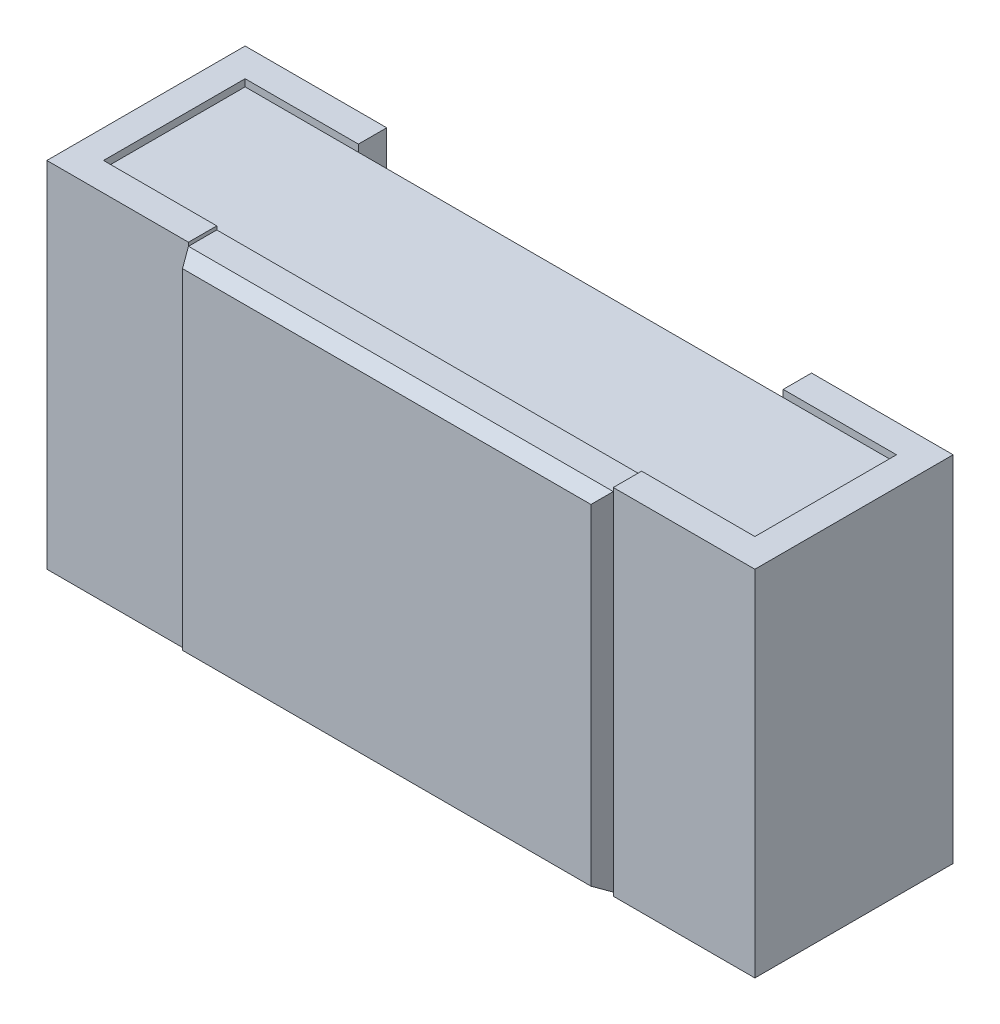
ISO-10303-21;
HEADER;
FILE_DESCRIPTION(('STEP AP214'),'2;1');
FILE_NAME('part.step','',(''),(''),'','','');
FILE_SCHEMA(('AUTOMOTIVE_DESIGN { 1 0 10303 214 1 1 1 1 }'));
ENDSEC;
DATA;
#1=APPLICATION_CONTEXT('core data for automotive mechanical design processes');
#2=APPLICATION_PROTOCOL_DEFINITION('international standard','automotive_design',2000,#1);
#3=PRODUCT_CONTEXT('',#1,'mechanical');
#4=PRODUCT('Part','Part','',(#3));
#5=PRODUCT_RELATED_PRODUCT_CATEGORY('part','',(#4));
#6=PRODUCT_DEFINITION_FORMATION('','',#4);
#7=PRODUCT_DEFINITION_CONTEXT('part definition',#1,'design');
#8=PRODUCT_DEFINITION('design','',#6,#7);
#9=PRODUCT_DEFINITION_SHAPE('','',#8);
#10=(LENGTH_UNIT() NAMED_UNIT(*) SI_UNIT(.MILLI.,.METRE.));
#11=(NAMED_UNIT(*) PLANE_ANGLE_UNIT() SI_UNIT($,.RADIAN.));
#12=(NAMED_UNIT(*) SI_UNIT($,.STERADIAN.) SOLID_ANGLE_UNIT());
#13=UNCERTAINTY_MEASURE_WITH_UNIT(LENGTH_MEASURE(1.E-05),#10,'distance_accuracy_value','');
#14=(GEOMETRIC_REPRESENTATION_CONTEXT(3) GLOBAL_UNCERTAINTY_ASSIGNED_CONTEXT((#13)) GLOBAL_UNIT_ASSIGNED_CONTEXT((#10,
#11,#12)) REPRESENTATION_CONTEXT('',''));
#15=CARTESIAN_POINT('',(0.,0.,0.));
#16=DIRECTION('',(0.,0.,1.));
#17=DIRECTION('',(1.,0.,0.));
#18=AXIS2_PLACEMENT_3D('',#15,#16,#17);
#19=CARTESIAN_POINT('',(-0.3,-0.25,0.28));
#20=DIRECTION('',(1.,0.,0.));
#21=DIRECTION('',(0.,0.,-1.));
#22=AXIS2_PLACEMENT_3D('',#19,#20,#21);
#23=PLANE('',#22);
#24=DIRECTION('',(0.,0.,1.));
#25=VECTOR('',#24,1.);
#26=CARTESIAN_POINT('',(-0.3,-0.245,0.24));
#27=LINE('',#26,#25);
#28=CARTESIAN_POINT('',(-0.3,-0.245,0.24));
#29=VERTEX_POINT('',#28);
#30=CARTESIAN_POINT('',(-0.3,-0.245,0.28));
#31=VERTEX_POINT('',#30);
#32=EDGE_CURVE('E292',#29,#31,#27,.T.);
#33=ORIENTED_EDGE('',*,*,#32,.T.);
#34=DIRECTION('',(0.,1.,0.));
#35=VECTOR('',#34,1.);
#36=CARTESIAN_POINT('',(-0.3,-0.25,0.28));
#37=LINE('',#36,#35);
#38=CARTESIAN_POINT('',(-0.3,-0.25,0.28));
#39=VERTEX_POINT('',#38);
#40=EDGE_CURVE('E484',#39,#31,#37,.T.);
#41=ORIENTED_EDGE('',*,*,#40,.F.);
#42=DIRECTION('',(0.,0.,-1.));
#43=VECTOR('',#42,1.);
#44=CARTESIAN_POINT('',(-0.3,-0.25,0.28));
#45=LINE('',#44,#43);
#46=CARTESIAN_POINT('',(-0.3,-0.25,0.24));
#47=VERTEX_POINT('',#46);
#48=EDGE_CURVE('E435',#39,#47,#45,.T.);
#49=ORIENTED_EDGE('',*,*,#48,.T.);
#50=DIRECTION('',(0.,1.,0.));
#51=VECTOR('',#50,1.);
#52=CARTESIAN_POINT('',(-0.3,-0.25,0.24));
#53=LINE('',#52,#51);
#54=EDGE_CURVE('E60',#47,#29,#53,.T.);
#55=ORIENTED_EDGE('',*,*,#54,.T.);
#56=EDGE_LOOP('',(#33,#41,#49,#55));
#57=FACE_BOUND('',#56,.T.);
#58=ADVANCED_FACE('F36',(#57),#23,.T.);
#59=CARTESIAN_POINT('',(0.3,-0.25,0.28));
#60=DIRECTION('',(-1.,0.,0.));
#61=DIRECTION('',(0.,0.,1.));
#62=AXIS2_PLACEMENT_3D('',#59,#60,#61);
#63=PLANE('',#62);
#64=DIRECTION('',(0.,0.,1.));
#65=VECTOR('',#64,1.);
#66=CARTESIAN_POINT('',(0.3,-0.245,0.24));
#67=LINE('',#66,#65);
#68=CARTESIAN_POINT('',(0.3,-0.245,0.24));
#69=VERTEX_POINT('',#68);
#70=CARTESIAN_POINT('',(0.3,-0.245,0.28));
#71=VERTEX_POINT('',#70);
#72=EDGE_CURVE('E288',#69,#71,#67,.T.);
#73=ORIENTED_EDGE('',*,*,#72,.F.);
#74=DIRECTION('',(0.,1.,0.));
#75=VECTOR('',#74,1.);
#76=CARTESIAN_POINT('',(0.3,-0.25,0.24));
#77=LINE('',#76,#75);
#78=CARTESIAN_POINT('',(0.3,-0.25,0.24));
#79=VERTEX_POINT('',#78);
#80=EDGE_CURVE('E363',#79,#69,#77,.T.);
#81=ORIENTED_EDGE('',*,*,#80,.F.);
#82=DIRECTION('',(0.,0.,1.));
#83=VECTOR('',#82,1.);
#84=CARTESIAN_POINT('',(0.3,-0.25,0.28));
#85=LINE('',#84,#83);
#86=CARTESIAN_POINT('',(0.3,-0.25,0.28));
#87=VERTEX_POINT('',#86);
#88=EDGE_CURVE('E330',#79,#87,#85,.T.);
#89=ORIENTED_EDGE('',*,*,#88,.T.);
#90=DIRECTION('',(0.,1.,0.));
#91=VECTOR('',#90,1.);
#92=CARTESIAN_POINT('',(0.3,-0.25,0.28));
#93=LINE('',#92,#91);
#94=EDGE_CURVE('E392',#87,#71,#93,.T.);
#95=ORIENTED_EDGE('',*,*,#94,.T.);
#96=EDGE_LOOP('',(#73,#81,#89,#95));
#97=FACE_BOUND('',#96,.T.);
#98=ADVANCED_FACE('F585',(#97),#63,.T.);
#99=CARTESIAN_POINT('',(-0.46,0.24,0.24));
#100=DIRECTION('',(0.,-1.,0.));
#101=DIRECTION('',(0.,0.,-1.));
#102=AXIS2_PLACEMENT_3D('',#99,#100,#101);
#103=PLANE('',#102);
#104=DIRECTION('',(-1.,0.,0.));
#105=VECTOR('',#104,1.);
#106=CARTESIAN_POINT('',(-0.46,0.24,0.04));
#107=LINE('',#106,#105);
#108=CARTESIAN_POINT('',(0.46,0.24,0.04));
#109=VERTEX_POINT('',#108);
#110=CARTESIAN_POINT('',(0.3,0.24,0.04));
#111=VERTEX_POINT('',#110);
#112=EDGE_CURVE('E499',#109,#111,#107,.T.);
#113=ORIENTED_EDGE('',*,*,#112,.T.);
#114=CARTESIAN_POINT('',(-0.3,0.24,0.04));
#115=VERTEX_POINT('',#114);
#116=EDGE_CURVE('E504',#111,#115,#107,.T.);
#117=ORIENTED_EDGE('',*,*,#116,.T.);
#118=CARTESIAN_POINT('',(-0.46,0.24,0.04));
#119=VERTEX_POINT('',#118);
#120=EDGE_CURVE('E462',#115,#119,#107,.T.);
#121=ORIENTED_EDGE('',*,*,#120,.T.);
#122=DIRECTION('',(0.,0.,-1.));
#123=VECTOR('',#122,1.);
#124=CARTESIAN_POINT('',(-0.46,0.24,0.24));
#125=LINE('',#124,#123);
#126=CARTESIAN_POINT('',(-0.46,0.24,0.24));
#127=VERTEX_POINT('',#126);
#128=EDGE_CURVE('E515',#127,#119,#125,.T.);
#129=ORIENTED_EDGE('',*,*,#128,.F.);
#130=DIRECTION('',(-1.,0.,0.));
#131=VECTOR('',#130,1.);
#132=CARTESIAN_POINT('',(-0.46,0.24,0.24));
#133=LINE('',#132,#131);
#134=CARTESIAN_POINT('',(0.46,0.24,0.24));
#135=VERTEX_POINT('',#134);
#136=EDGE_CURVE('E491',#135,#127,#133,.T.);
#137=ORIENTED_EDGE('',*,*,#136,.F.);
#138=DIRECTION('',(0.,0.,-1.));
#139=VECTOR('',#138,1.);
#140=CARTESIAN_POINT('',(0.46,0.24,0.24));
#141=LINE('',#140,#139);
#142=EDGE_CURVE('E518',#135,#109,#141,.T.);
#143=ORIENTED_EDGE('',*,*,#142,.T.);
#144=EDGE_LOOP('',(#113,#117,#121,#129,#137,#143));
#145=FACE_BOUND('',#144,.T.);
#146=ADVANCED_FACE('F38',(#145),#103,.F.);
#147=CARTESIAN_POINT('',(-0.46,-0.24,0.24));
#148=DIRECTION('',(0.,1.,0.));
#149=DIRECTION('',(0.,0.,1.));
#150=AXIS2_PLACEMENT_3D('',#147,#148,#149);
#151=PLANE('',#150);
#152=DIRECTION('',(1.,0.,0.));
#153=VECTOR('',#152,1.);
#154=CARTESIAN_POINT('',(-0.46,-0.24,0.04));
#155=LINE('',#154,#153);
#156=CARTESIAN_POINT('',(-0.46,-0.24,0.04));
#157=VERTEX_POINT('',#156);
#158=CARTESIAN_POINT('',(-0.3,-0.24,0.04));
#159=VERTEX_POINT('',#158);
#160=EDGE_CURVE('E495',#157,#159,#155,.T.);
#161=ORIENTED_EDGE('',*,*,#160,.T.);
#162=CARTESIAN_POINT('',(0.3,-0.24,0.04));
#163=VERTEX_POINT('',#162);
#164=EDGE_CURVE('E508',#159,#163,#155,.T.);
#165=ORIENTED_EDGE('',*,*,#164,.T.);
#166=CARTESIAN_POINT('',(0.46,-0.24,0.04));
#167=VERTEX_POINT('',#166);
#168=EDGE_CURVE('E503',#163,#167,#155,.T.);
#169=ORIENTED_EDGE('',*,*,#168,.T.);
#170=DIRECTION('',(0.,0.,-1.));
#171=VECTOR('',#170,1.);
#172=CARTESIAN_POINT('',(0.46,-0.24,0.24));
#173=LINE('',#172,#171);
#174=CARTESIAN_POINT('',(0.46,-0.24,0.24));
#175=VERTEX_POINT('',#174);
#176=EDGE_CURVE('E498',#175,#167,#173,.T.);
#177=ORIENTED_EDGE('',*,*,#176,.F.);
#178=DIRECTION('',(1.,0.,0.));
#179=VECTOR('',#178,1.);
#180=CARTESIAN_POINT('',(-0.46,-0.24,0.24));
#181=LINE('',#180,#179);
#182=CARTESIAN_POINT('',(-0.46,-0.24,0.24));
#183=VERTEX_POINT('',#182);
#184=EDGE_CURVE('E494',#183,#175,#181,.T.);
#185=ORIENTED_EDGE('',*,*,#184,.F.);
#186=DIRECTION('',(0.,0.,-1.));
#187=VECTOR('',#186,1.);
#188=CARTESIAN_POINT('',(-0.46,-0.24,0.24));
#189=LINE('',#188,#187);
#190=EDGE_CURVE('E511',#183,#157,#189,.T.);
#191=ORIENTED_EDGE('',*,*,#190,.T.);
#192=EDGE_LOOP('',(#161,#165,#169,#177,#185,#191));
#193=FACE_BOUND('',#192,.T.);
#194=ADVANCED_FACE('F551',(#193),#151,.F.);
#195=CARTESIAN_POINT('',(0.46,-0.24,0.04));
#196=DIRECTION('',(0.,0.,1.));
#197=DIRECTION('',(1.,0.,0.));
#198=AXIS2_PLACEMENT_3D('',#195,#196,#197);
#199=PLANE('',#198);
#200=ORIENTED_EDGE('',*,*,#116,.F.);
#201=DIRECTION('',(0.,-1.,0.));
#202=VECTOR('',#201,1.);
#203=CARTESIAN_POINT('',(0.3,-0.24,0.04));
#204=LINE('',#203,#202);
#205=EDGE_CURVE('E11',#111,#163,#204,.T.);
#206=ORIENTED_EDGE('',*,*,#205,.T.);
#207=ORIENTED_EDGE('',*,*,#164,.F.);
#208=DIRECTION('',(0.,1.,0.));
#209=VECTOR('',#208,1.);
#210=CARTESIAN_POINT('',(-0.3,-0.24,0.04));
#211=LINE('',#210,#209);
#212=EDGE_CURVE('E45',#159,#115,#211,.T.);
#213=ORIENTED_EDGE('',*,*,#212,.T.);
#214=EDGE_LOOP('',(#200,#206,#207,#213));
#215=FACE_BOUND('',#214,.T.);
#216=ADVANCED_FACE('F527',(#215),#199,.F.);
#217=CARTESIAN_POINT('',(-0.46,-0.25,0.04));
#218=DIRECTION('',(0.,0.,1.));
#219=DIRECTION('',(1.,0.,0.));
#220=AXIS2_PLACEMENT_3D('',#217,#218,#219);
#221=PLANE('',#220);
#222=ORIENTED_EDGE('',*,*,#120,.F.);
#223=DIRECTION('',(0.,1.,0.));
#224=VECTOR('',#223,1.);
#225=CARTESIAN_POINT('',(-0.3,-0.25,0.04));
#226=LINE('',#225,#224);
#227=CARTESIAN_POINT('',(-0.3,0.25,0.04));
#228=VERTEX_POINT('',#227);
#229=EDGE_CURVE('E470',#115,#228,#226,.T.);
#230=ORIENTED_EDGE('',*,*,#229,.T.);
#231=DIRECTION('',(1.,0.,0.));
#232=VECTOR('',#231,1.);
#233=CARTESIAN_POINT('',(-0.46,0.25,0.04));
#234=LINE('',#233,#232);
#235=CARTESIAN_POINT('',(-0.46,0.25,0.04));
#236=VERTEX_POINT('',#235);
#237=EDGE_CURVE('E415',#236,#228,#234,.T.);
#238=ORIENTED_EDGE('',*,*,#237,.F.);
#239=DIRECTION('',(0.,1.,0.));
#240=VECTOR('',#239,1.);
#241=CARTESIAN_POINT('',(-0.46,-0.25,0.04));
#242=LINE('',#241,#240);
#243=EDGE_CURVE('E475',#119,#236,#242,.T.);
#244=ORIENTED_EDGE('',*,*,#243,.F.);
#245=EDGE_LOOP('',(#222,#230,#238,#244));
#246=FACE_BOUND('',#245,.T.);
#247=ADVANCED_FACE('F638',(#246),#221,.T.);
#248=ORIENTED_EDGE('',*,*,#160,.F.);
#249=CARTESIAN_POINT('',(-0.46,-0.25,0.04));
#250=VERTEX_POINT('',#249);
#251=EDGE_CURVE('E471',#250,#157,#242,.T.);
#252=ORIENTED_EDGE('',*,*,#251,.F.);
#253=DIRECTION('',(1.,0.,0.));
#254=VECTOR('',#253,1.);
#255=CARTESIAN_POINT('',(-0.46,-0.25,0.04));
#256=LINE('',#255,#254);
#257=CARTESIAN_POINT('',(-0.3,-0.25,0.04));
#258=VERTEX_POINT('',#257);
#259=EDGE_CURVE('E446',#250,#258,#256,.T.);
#260=ORIENTED_EDGE('',*,*,#259,.T.);
#261=EDGE_CURVE('E466',#258,#159,#226,.T.);
#262=ORIENTED_EDGE('',*,*,#261,.T.);
#263=EDGE_LOOP('',(#248,#252,#260,#262));
#264=FACE_BOUND('',#263,.T.);
#265=ADVANCED_FACE('F536',(#264),#221,.T.);
#266=CARTESIAN_POINT('',(-0.3,-0.25,0.24));
#267=DIRECTION('',(0.,0.,-1.));
#268=DIRECTION('',(-1.,0.,0.));
#269=AXIS2_PLACEMENT_3D('',#266,#267,#268);
#270=PLANE('',#269);
#271=ORIENTED_EDGE('',*,*,#136,.T.);
#272=DIRECTION('',(0.,1.,0.));
#273=VECTOR('',#272,1.);
#274=CARTESIAN_POINT('',(-0.46,-0.25,0.24));
#275=LINE('',#274,#273);
#276=CARTESIAN_POINT('',(-0.46,0.25,0.24));
#277=VERTEX_POINT('',#276);
#278=EDGE_CURVE('E480',#127,#277,#275,.T.);
#279=ORIENTED_EDGE('',*,*,#278,.T.);
#280=DIRECTION('',(-1.,0.,0.));
#281=VECTOR('',#280,1.);
#282=CARTESIAN_POINT('',(-0.3,0.25,0.24));
#283=LINE('',#282,#281);
#284=CARTESIAN_POINT('',(-0.3,0.25,0.24));
#285=VERTEX_POINT('',#284);
#286=EDGE_CURVE('E407',#285,#277,#283,.T.);
#287=ORIENTED_EDGE('',*,*,#286,.F.);
#288=CARTESIAN_POINT('',(-0.3,0.245,0.24));
#289=VERTEX_POINT('',#288);
#290=EDGE_CURVE('E483',#289,#285,#53,.T.);
#291=ORIENTED_EDGE('',*,*,#290,.F.);
#292=DIRECTION('',(-1.,0.,0.));
#293=VECTOR('',#292,1.);
#294=CARTESIAN_POINT('',(-0.3,0.245,0.24));
#295=LINE('',#294,#293);
#296=CARTESIAN_POINT('',(0.3,0.245,0.24));
#297=VERTEX_POINT('',#296);
#298=EDGE_CURVE('E269',#297,#289,#295,.T.);
#299=ORIENTED_EDGE('',*,*,#298,.F.);
#300=CARTESIAN_POINT('',(0.3,0.25,0.24));
#301=VERTEX_POINT('',#300);
#302=EDGE_CURVE('E368',#297,#301,#77,.T.);
#303=ORIENTED_EDGE('',*,*,#302,.T.);
#304=DIRECTION('',(-1.,0.,0.));
#305=VECTOR('',#304,1.);
#306=CARTESIAN_POINT('',(0.3,0.25,0.24));
#307=LINE('',#306,#305);
#308=CARTESIAN_POINT('',(0.46,0.25,0.24));
#309=VERTEX_POINT('',#308);
#310=EDGE_CURVE('E326',#309,#301,#307,.T.);
#311=ORIENTED_EDGE('',*,*,#310,.F.);
#312=DIRECTION('',(0.,1.,0.));
#313=VECTOR('',#312,1.);
#314=CARTESIAN_POINT('',(0.46,-0.25,0.24));
#315=LINE('',#314,#313);
#316=EDGE_CURVE('E373',#135,#309,#315,.T.);
#317=ORIENTED_EDGE('',*,*,#316,.F.);
#318=EDGE_LOOP('',(#271,#279,#287,#291,#299,#303,#311,#317));
#319=FACE_BOUND('',#318,.T.);
#320=ADVANCED_FACE('F605',(#319),#270,.T.);
#321=ORIENTED_EDGE('',*,*,#184,.T.);
#322=CARTESIAN_POINT('',(0.46,-0.25,0.24));
#323=VERTEX_POINT('',#322);
#324=EDGE_CURVE('E369',#323,#175,#315,.T.);
#325=ORIENTED_EDGE('',*,*,#324,.F.);
#326=DIRECTION('',(-1.,0.,0.));
#327=VECTOR('',#326,1.);
#328=CARTESIAN_POINT('',(0.3,-0.25,0.24));
#329=LINE('',#328,#327);
#330=EDGE_CURVE('E358',#323,#79,#329,.T.);
#331=ORIENTED_EDGE('',*,*,#330,.T.);
#332=ORIENTED_EDGE('',*,*,#80,.T.);
#333=DIRECTION('',(1.,0.,0.));
#334=VECTOR('',#333,1.);
#335=CARTESIAN_POINT('',(-0.3,-0.245,0.24));
#336=LINE('',#335,#334);
#337=EDGE_CURVE('E273',#29,#69,#336,.T.);
#338=ORIENTED_EDGE('',*,*,#337,.F.);
#339=ORIENTED_EDGE('',*,*,#54,.F.);
#340=DIRECTION('',(-1.,0.,0.));
#341=VECTOR('',#340,1.);
#342=CARTESIAN_POINT('',(-0.3,-0.25,0.24));
#343=LINE('',#342,#341);
#344=CARTESIAN_POINT('',(-0.46,-0.25,0.24));
#345=VERTEX_POINT('',#344);
#346=EDGE_CURVE('E438',#47,#345,#343,.T.);
#347=ORIENTED_EDGE('',*,*,#346,.T.);
#348=EDGE_CURVE('E476',#345,#183,#275,.T.);
#349=ORIENTED_EDGE('',*,*,#348,.T.);
#350=EDGE_LOOP('',(#321,#325,#331,#332,#338,#339,#347,#349));
#351=FACE_BOUND('',#350,.T.);
#352=ADVANCED_FACE('F548',(#351),#270,.T.);
#353=CARTESIAN_POINT('',(-0.46,-0.25,0.04));
#354=DIRECTION('',(1.,0.,0.));
#355=DIRECTION('',(0.,0.,-1.));
#356=AXIS2_PLACEMENT_3D('',#353,#354,#355);
#357=PLANE('',#356);
#358=ORIENTED_EDGE('',*,*,#128,.T.);
#359=ORIENTED_EDGE('',*,*,#243,.T.);
#360=DIRECTION('',(0.,0.,-1.));
#361=VECTOR('',#360,1.);
#362=CARTESIAN_POINT('',(-0.46,0.25,0.04));
#363=LINE('',#362,#361);
#364=EDGE_CURVE('E411',#277,#236,#363,.T.);
#365=ORIENTED_EDGE('',*,*,#364,.F.);
#366=ORIENTED_EDGE('',*,*,#278,.F.);
#367=EDGE_LOOP('',(#358,#359,#365,#366));
#368=FACE_BOUND('',#367,.T.);
#369=ADVANCED_FACE('F634',(#368),#357,.T.);
#370=ORIENTED_EDGE('',*,*,#190,.F.);
#371=ORIENTED_EDGE('',*,*,#348,.F.);
#372=DIRECTION('',(0.,0.,-1.));
#373=VECTOR('',#372,1.);
#374=CARTESIAN_POINT('',(-0.46,-0.25,0.04));
#375=LINE('',#374,#373);
#376=EDGE_CURVE('E442',#345,#250,#375,.T.);
#377=ORIENTED_EDGE('',*,*,#376,.T.);
#378=ORIENTED_EDGE('',*,*,#251,.T.);
#379=EDGE_LOOP('',(#370,#371,#377,#378));
#380=FACE_BOUND('',#379,.T.);
#381=ADVANCED_FACE('F545',(#380),#357,.T.);
#382=CARTESIAN_POINT('',(-0.5,-0.25,0.));
#383=DIRECTION('',(-1.,0.,0.));
#384=DIRECTION('',(0.,0.,1.));
#385=AXIS2_PLACEMENT_3D('',#382,#383,#384);
#386=PLANE('',#385);
#387=DIRECTION('',(0.,1.,0.));
#388=VECTOR('',#387,1.);
#389=CARTESIAN_POINT('',(-0.5,-0.25,0.28));
#390=LINE('',#389,#388);
#391=CARTESIAN_POINT('',(-0.5,-0.25,0.28));
#392=VERTEX_POINT('',#391);
#393=CARTESIAN_POINT('',(-0.5,0.25,0.28));
#394=VERTEX_POINT('',#393);
#395=EDGE_CURVE('E458',#392,#394,#390,.T.);
#396=ORIENTED_EDGE('',*,*,#395,.T.);
#397=DIRECTION('',(0.,0.,1.));
#398=VECTOR('',#397,1.);
#399=CARTESIAN_POINT('',(-0.5,0.25,0.));
#400=LINE('',#399,#398);
#401=CARTESIAN_POINT('',(-0.5,0.25,0.));
#402=VERTEX_POINT('',#401);
#403=EDGE_CURVE('E367',#402,#394,#400,.T.);
#404=ORIENTED_EDGE('',*,*,#403,.F.);
#405=DIRECTION('',(0.,1.,0.));
#406=VECTOR('',#405,1.);
#407=CARTESIAN_POINT('',(-0.5,-0.25,0.));
#408=LINE('',#407,#406);
#409=CARTESIAN_POINT('',(-0.5,-0.25,0.));
#410=VERTEX_POINT('',#409);
#411=EDGE_CURVE('E459',#410,#402,#408,.T.);
#412=ORIENTED_EDGE('',*,*,#411,.F.);
#413=DIRECTION('',(0.,0.,1.));
#414=VECTOR('',#413,1.);
#415=CARTESIAN_POINT('',(-0.5,-0.25,0.));
#416=LINE('',#415,#414);
#417=EDGE_CURVE('E427',#410,#392,#416,.T.);
#418=ORIENTED_EDGE('',*,*,#417,.T.);
#419=EDGE_LOOP('',(#396,#404,#412,#418));
#420=FACE_BOUND('',#419,.T.);
#421=ADVANCED_FACE('F648',(#420),#386,.T.);
#422=CARTESIAN_POINT('',(-0.5,-0.25,0.));
#423=DIRECTION('',(0.,0.,-1.));
#424=DIRECTION('',(-1.,0.,0.));
#425=AXIS2_PLACEMENT_3D('',#422,#423,#424);
#426=PLANE('',#425);
#427=ORIENTED_EDGE('',*,*,#411,.T.);
#428=DIRECTION('',(-1.,0.,0.));
#429=VECTOR('',#428,1.);
#430=CARTESIAN_POINT('',(-0.5,0.25,0.));
#431=LINE('',#430,#429);
#432=CARTESIAN_POINT('',(-0.3,0.25,0.));
#433=VERTEX_POINT('',#432);
#434=EDGE_CURVE('E423',#433,#402,#431,.T.);
#435=ORIENTED_EDGE('',*,*,#434,.F.);
#436=DIRECTION('',(0.,1.,0.));
#437=VECTOR('',#436,1.);
#438=CARTESIAN_POINT('',(-0.3,-0.25,0.));
#439=LINE('',#438,#437);
#440=CARTESIAN_POINT('',(-0.3,-0.25,0.));
#441=VERTEX_POINT('',#440);
#442=EDGE_CURVE('E463',#441,#433,#439,.T.);
#443=ORIENTED_EDGE('',*,*,#442,.F.);
#444=DIRECTION('',(-1.,0.,0.));
#445=VECTOR('',#444,1.);
#446=CARTESIAN_POINT('',(-0.5,-0.25,0.));
#447=LINE('',#446,#445);
#448=EDGE_CURVE('E454',#441,#410,#447,.T.);
#449=ORIENTED_EDGE('',*,*,#448,.T.);
#450=EDGE_LOOP('',(#427,#435,#443,#449));
#451=FACE_BOUND('',#450,.T.);
#452=ADVANCED_FACE('F645',(#451),#426,.T.);
#453=CARTESIAN_POINT('',(-0.3,-0.25,0.));
#454=DIRECTION('',(1.,0.,0.));
#455=DIRECTION('',(0.,0.,-1.));
#456=AXIS2_PLACEMENT_3D('',#453,#454,#455);
#457=PLANE('',#456);
#458=ORIENTED_EDGE('',*,*,#442,.T.);
#459=DIRECTION('',(0.,0.,-1.));
#460=VECTOR('',#459,1.);
#461=CARTESIAN_POINT('',(-0.3,0.25,0.));
#462=LINE('',#461,#460);
#463=EDGE_CURVE('E419',#228,#433,#462,.T.);
#464=ORIENTED_EDGE('',*,*,#463,.F.);
#465=ORIENTED_EDGE('',*,*,#229,.F.);
#466=ORIENTED_EDGE('',*,*,#212,.F.);
#467=ORIENTED_EDGE('',*,*,#261,.F.);
#468=DIRECTION('',(0.,0.,-1.));
#469=VECTOR('',#468,1.);
#470=CARTESIAN_POINT('',(-0.3,-0.25,0.));
#471=LINE('',#470,#469);
#472=EDGE_CURVE('E450',#258,#441,#471,.T.);
#473=ORIENTED_EDGE('',*,*,#472,.T.);
#474=EDGE_LOOP('',(#458,#464,#465,#466,#467,#473));
#475=FACE_BOUND('',#474,.T.);
#476=ADVANCED_FACE('F531',(#475),#457,.T.);
#477=DIRECTION('',(0.,0.,1.));
#478=VECTOR('',#477,1.);
#479=CARTESIAN_POINT('',(-0.3,0.245,0.24));
#480=LINE('',#479,#478);
#481=CARTESIAN_POINT('',(-0.3,0.245,0.28));
#482=VERTEX_POINT('',#481);
#483=EDGE_CURVE('E52',#289,#482,#480,.T.);
#484=ORIENTED_EDGE('',*,*,#483,.F.);
#485=ORIENTED_EDGE('',*,*,#290,.T.);
#486=DIRECTION('',(0.,0.,-1.));
#487=VECTOR('',#486,1.);
#488=CARTESIAN_POINT('',(-0.3,0.25,0.28));
#489=LINE('',#488,#487);
#490=CARTESIAN_POINT('',(-0.3,0.25,0.28));
#491=VERTEX_POINT('',#490);
#492=EDGE_CURVE('E403',#491,#285,#489,.T.);
#493=ORIENTED_EDGE('',*,*,#492,.F.);
#494=EDGE_CURVE('E488',#482,#491,#37,.T.);
#495=ORIENTED_EDGE('',*,*,#494,.F.);
#496=EDGE_LOOP('',(#484,#485,#493,#495));
#497=FACE_BOUND('',#496,.T.);
#498=ADVANCED_FACE('F650',(#497),#23,.T.);
#499=CARTESIAN_POINT('',(-0.5,-0.25,0.28));
#500=DIRECTION('',(0.,0.,1.));
#501=DIRECTION('',(1.,0.,0.));
#502=AXIS2_PLACEMENT_3D('',#499,#500,#501);
#503=PLANE('',#502);
#504=ORIENTED_EDGE('',*,*,#40,.T.);
#505=DIRECTION('',(0.,-1.,0.));
#506=VECTOR('',#505,1.);
#507=CARTESIAN_POINT('',(-0.3,0.245,0.28));
#508=LINE('',#507,#506);
#509=EDGE_CURVE('E281',#482,#31,#508,.T.);
#510=ORIENTED_EDGE('',*,*,#509,.F.);
#511=ORIENTED_EDGE('',*,*,#494,.T.);
#512=DIRECTION('',(1.,0.,0.));
#513=VECTOR('',#512,1.);
#514=CARTESIAN_POINT('',(-0.5,0.25,0.28));
#515=LINE('',#514,#513);
#516=EDGE_CURVE('E399',#394,#491,#515,.T.);
#517=ORIENTED_EDGE('',*,*,#516,.F.);
#518=ORIENTED_EDGE('',*,*,#395,.F.);
#519=DIRECTION('',(1.,0.,0.));
#520=VECTOR('',#519,1.);
#521=CARTESIAN_POINT('',(-0.5,-0.25,0.28));
#522=LINE('',#521,#520);
#523=EDGE_CURVE('E431',#392,#39,#522,.T.);
#524=ORIENTED_EDGE('',*,*,#523,.T.);
#525=EDGE_LOOP('',(#504,#510,#511,#517,#518,#524));
#526=FACE_BOUND('',#525,.T.);
#527=ADVANCED_FACE('F597',(#526),#503,.T.);
#528=CARTESIAN_POINT('',(-0.5,-0.25,0.28));
#529=DIRECTION('',(0.,1.,0.));
#530=DIRECTION('',(0.,0.,1.));
#531=AXIS2_PLACEMENT_3D('',#528,#529,#530);
#532=PLANE('',#531);
#533=ORIENTED_EDGE('',*,*,#417,.F.);
#534=ORIENTED_EDGE('',*,*,#448,.F.);
#535=ORIENTED_EDGE('',*,*,#472,.F.);
#536=ORIENTED_EDGE('',*,*,#259,.F.);
#537=ORIENTED_EDGE('',*,*,#376,.F.);
#538=ORIENTED_EDGE('',*,*,#346,.F.);
#539=ORIENTED_EDGE('',*,*,#48,.F.);
#540=ORIENTED_EDGE('',*,*,#523,.F.);
#541=EDGE_LOOP('',(#533,#534,#535,#536,#537,#538,#539,#540));
#542=FACE_BOUND('',#541,.T.);
#543=ADVANCED_FACE('F541',(#542),#532,.F.);
#544=CARTESIAN_POINT('',(-0.5,0.25,0.28));
#545=DIRECTION('',(0.,1.,0.));
#546=DIRECTION('',(0.,0.,1.));
#547=AXIS2_PLACEMENT_3D('',#544,#545,#546);
#548=PLANE('',#547);
#549=ORIENTED_EDGE('',*,*,#403,.T.);
#550=ORIENTED_EDGE('',*,*,#516,.T.);
#551=ORIENTED_EDGE('',*,*,#492,.T.);
#552=ORIENTED_EDGE('',*,*,#286,.T.);
#553=ORIENTED_EDGE('',*,*,#364,.T.);
#554=ORIENTED_EDGE('',*,*,#237,.T.);
#555=ORIENTED_EDGE('',*,*,#463,.T.);
#556=ORIENTED_EDGE('',*,*,#434,.T.);
#557=EDGE_LOOP('',(#549,#550,#551,#552,#553,#554,#555,#556));
#558=FACE_BOUND('',#557,.T.);
#559=ADVANCED_FACE('F642',(#558),#548,.T.);
#560=CARTESIAN_POINT('',(0.46,-0.25,0.04));
#561=DIRECTION('',(0.,0.,1.));
#562=DIRECTION('',(1.,0.,0.));
#563=AXIS2_PLACEMENT_3D('',#560,#561,#562);
#564=PLANE('',#563);
#565=ORIENTED_EDGE('',*,*,#112,.F.);
#566=DIRECTION('',(0.,1.,0.));
#567=VECTOR('',#566,1.);
#568=CARTESIAN_POINT('',(0.46,-0.25,0.04));
#569=LINE('',#568,#567);
#570=CARTESIAN_POINT('',(0.46,0.25,0.04));
#571=VERTEX_POINT('',#570);
#572=EDGE_CURVE('E378',#109,#571,#569,.T.);
#573=ORIENTED_EDGE('',*,*,#572,.T.);
#574=DIRECTION('',(1.,0.,0.));
#575=VECTOR('',#574,1.);
#576=CARTESIAN_POINT('',(0.46,0.25,0.04));
#577=LINE('',#576,#575);
#578=CARTESIAN_POINT('',(0.3,0.25,0.04));
#579=VERTEX_POINT('',#578);
#580=EDGE_CURVE('E318',#579,#571,#577,.T.);
#581=ORIENTED_EDGE('',*,*,#580,.F.);
#582=DIRECTION('',(0.,1.,0.));
#583=VECTOR('',#582,1.);
#584=CARTESIAN_POINT('',(0.3,-0.25,0.04));
#585=LINE('',#584,#583);
#586=EDGE_CURVE('E382',#111,#579,#585,.T.);
#587=ORIENTED_EDGE('',*,*,#586,.F.);
#588=EDGE_LOOP('',(#565,#573,#581,#587));
#589=FACE_BOUND('',#588,.T.);
#590=ADVANCED_FACE('F620',(#589),#564,.T.);
#591=ORIENTED_EDGE('',*,*,#168,.F.);
#592=CARTESIAN_POINT('',(0.3,-0.25,0.04));
#593=VERTEX_POINT('',#592);
#594=EDGE_CURVE('E379',#593,#163,#585,.T.);
#595=ORIENTED_EDGE('',*,*,#594,.F.);
#596=DIRECTION('',(1.,0.,0.));
#597=VECTOR('',#596,1.);
#598=CARTESIAN_POINT('',(0.46,-0.25,0.04));
#599=LINE('',#598,#597);
#600=CARTESIAN_POINT('',(0.46,-0.25,0.04));
#601=VERTEX_POINT('',#600);
#602=EDGE_CURVE('E350',#593,#601,#599,.T.);
#603=ORIENTED_EDGE('',*,*,#602,.T.);
#604=EDGE_CURVE('E374',#601,#167,#569,.T.);
#605=ORIENTED_EDGE('',*,*,#604,.T.);
#606=EDGE_LOOP('',(#591,#595,#603,#605));
#607=FACE_BOUND('',#606,.T.);
#608=ADVANCED_FACE('F558',(#607),#564,.T.);
#609=CARTESIAN_POINT('',(0.46,-0.25,0.04));
#610=DIRECTION('',(-1.,0.,0.));
#611=DIRECTION('',(0.,0.,1.));
#612=AXIS2_PLACEMENT_3D('',#609,#610,#611);
#613=PLANE('',#612);
#614=ORIENTED_EDGE('',*,*,#142,.F.);
#615=ORIENTED_EDGE('',*,*,#316,.T.);
#616=DIRECTION('',(0.,0.,1.));
#617=VECTOR('',#616,1.);
#618=CARTESIAN_POINT('',(0.46,0.25,0.04));
#619=LINE('',#618,#617);
#620=EDGE_CURVE('E322',#571,#309,#619,.T.);
#621=ORIENTED_EDGE('',*,*,#620,.F.);
#622=ORIENTED_EDGE('',*,*,#572,.F.);
#623=EDGE_LOOP('',(#614,#615,#621,#622));
#624=FACE_BOUND('',#623,.T.);
#625=ADVANCED_FACE('F623',(#624),#613,.T.);
#626=ORIENTED_EDGE('',*,*,#176,.T.);
#627=ORIENTED_EDGE('',*,*,#604,.F.);
#628=DIRECTION('',(0.,0.,1.));
#629=VECTOR('',#628,1.);
#630=CARTESIAN_POINT('',(0.46,-0.25,0.04));
#631=LINE('',#630,#629);
#632=EDGE_CURVE('E354',#601,#323,#631,.T.);
#633=ORIENTED_EDGE('',*,*,#632,.T.);
#634=ORIENTED_EDGE('',*,*,#324,.T.);
#635=EDGE_LOOP('',(#626,#627,#633,#634));
#636=FACE_BOUND('',#635,.T.);
#637=ADVANCED_FACE('F555',(#636),#613,.T.);
#638=DIRECTION('',(0.,0.,1.));
#639=VECTOR('',#638,1.);
#640=CARTESIAN_POINT('',(0.3,0.245,0.24));
#641=LINE('',#640,#639);
#642=CARTESIAN_POINT('',(0.3,0.245,0.28));
#643=VERTEX_POINT('',#642);
#644=EDGE_CURVE('E277',#297,#643,#641,.T.);
#645=ORIENTED_EDGE('',*,*,#644,.T.);
#646=CARTESIAN_POINT('',(0.3,0.25,0.28));
#647=VERTEX_POINT('',#646);
#648=EDGE_CURVE('E362',#643,#647,#93,.T.);
#649=ORIENTED_EDGE('',*,*,#648,.T.);
#650=DIRECTION('',(0.,0.,1.));
#651=VECTOR('',#650,1.);
#652=CARTESIAN_POINT('',(0.3,0.25,0.28));
#653=LINE('',#652,#651);
#654=EDGE_CURVE('E291',#301,#647,#653,.T.);
#655=ORIENTED_EDGE('',*,*,#654,.F.);
#656=ORIENTED_EDGE('',*,*,#302,.F.);
#657=EDGE_LOOP('',(#645,#649,#655,#656));
#658=FACE_BOUND('',#657,.T.);
#659=ADVANCED_FACE('F630',(#658),#63,.T.);
#660=CARTESIAN_POINT('',(0.3,-0.25,0.));
#661=DIRECTION('',(-1.,0.,0.));
#662=DIRECTION('',(0.,0.,1.));
#663=AXIS2_PLACEMENT_3D('',#660,#661,#662);
#664=PLANE('',#663);
#665=ORIENTED_EDGE('',*,*,#594,.T.);
#666=ORIENTED_EDGE('',*,*,#205,.F.);
#667=ORIENTED_EDGE('',*,*,#586,.T.);
#668=DIRECTION('',(0.,0.,1.));
#669=VECTOR('',#668,1.);
#670=CARTESIAN_POINT('',(0.3,0.25,0.));
#671=LINE('',#670,#669);
#672=CARTESIAN_POINT('',(0.3,0.25,0.));
#673=VERTEX_POINT('',#672);
#674=EDGE_CURVE('E314',#673,#579,#671,.T.);
#675=ORIENTED_EDGE('',*,*,#674,.F.);
#676=DIRECTION('',(0.,1.,0.));
#677=VECTOR('',#676,1.);
#678=CARTESIAN_POINT('',(0.3,-0.25,0.));
#679=LINE('',#678,#677);
#680=CARTESIAN_POINT('',(0.3,-0.25,0.));
#681=VERTEX_POINT('',#680);
#682=EDGE_CURVE('E383',#681,#673,#679,.T.);
#683=ORIENTED_EDGE('',*,*,#682,.F.);
#684=DIRECTION('',(0.,0.,1.));
#685=VECTOR('',#684,1.);
#686=CARTESIAN_POINT('',(0.3,-0.25,0.));
#687=LINE('',#686,#685);
#688=EDGE_CURVE('E346',#681,#593,#687,.T.);
#689=ORIENTED_EDGE('',*,*,#688,.T.);
#690=EDGE_LOOP('',(#665,#666,#667,#675,#683,#689));
#691=FACE_BOUND('',#690,.T.);
#692=ADVANCED_FACE('F567',(#691),#664,.T.);
#693=CARTESIAN_POINT('',(0.5,-0.25,0.));
#694=DIRECTION('',(0.,0.,-1.));
#695=DIRECTION('',(-1.,0.,0.));
#696=AXIS2_PLACEMENT_3D('',#693,#694,#695);
#697=PLANE('',#696);
#698=ORIENTED_EDGE('',*,*,#682,.T.);
#699=DIRECTION('',(-1.,0.,0.));
#700=VECTOR('',#699,1.);
#701=CARTESIAN_POINT('',(0.5,0.25,0.));
#702=LINE('',#701,#700);
#703=CARTESIAN_POINT('',(0.5,0.25,0.));
#704=VERTEX_POINT('',#703);
#705=EDGE_CURVE('E310',#704,#673,#702,.T.);
#706=ORIENTED_EDGE('',*,*,#705,.F.);
#707=DIRECTION('',(0.,1.,0.));
#708=VECTOR('',#707,1.);
#709=CARTESIAN_POINT('',(0.5,-0.25,0.));
#710=LINE('',#709,#708);
#711=CARTESIAN_POINT('',(0.5,-0.25,0.));
#712=VERTEX_POINT('',#711);
#713=EDGE_CURVE('E386',#712,#704,#710,.T.);
#714=ORIENTED_EDGE('',*,*,#713,.F.);
#715=DIRECTION('',(-1.,0.,0.));
#716=VECTOR('',#715,1.);
#717=CARTESIAN_POINT('',(0.5,-0.25,0.));
#718=LINE('',#717,#716);
#719=EDGE_CURVE('E342',#712,#681,#718,.T.);
#720=ORIENTED_EDGE('',*,*,#719,.T.);
#721=EDGE_LOOP('',(#698,#706,#714,#720));
#722=FACE_BOUND('',#721,.T.);
#723=ADVANCED_FACE('F572',(#722),#697,.T.);
#724=CARTESIAN_POINT('',(0.5,-0.25,0.));
#725=DIRECTION('',(1.,0.,0.));
#726=DIRECTION('',(0.,0.,-1.));
#727=AXIS2_PLACEMENT_3D('',#724,#725,#726);
#728=PLANE('',#727);
#729=ORIENTED_EDGE('',*,*,#713,.T.);
#730=DIRECTION('',(0.,0.,-1.));
#731=VECTOR('',#730,1.);
#732=CARTESIAN_POINT('',(0.5,0.25,0.));
#733=LINE('',#732,#731);
#734=CARTESIAN_POINT('',(0.5,0.25,0.28));
#735=VERTEX_POINT('',#734);
#736=EDGE_CURVE('E307',#735,#704,#733,.T.);
#737=ORIENTED_EDGE('',*,*,#736,.F.);
#738=DIRECTION('',(0.,1.,0.));
#739=VECTOR('',#738,1.);
#740=CARTESIAN_POINT('',(0.5,-0.25,0.28));
#741=LINE('',#740,#739);
#742=CARTESIAN_POINT('',(0.5,-0.25,0.28));
#743=VERTEX_POINT('',#742);
#744=EDGE_CURVE('E389',#743,#735,#741,.T.);
#745=ORIENTED_EDGE('',*,*,#744,.F.);
#746=DIRECTION('',(0.,0.,-1.));
#747=VECTOR('',#746,1.);
#748=CARTESIAN_POINT('',(0.5,-0.25,0.));
#749=LINE('',#748,#747);
#750=EDGE_CURVE('E338',#743,#712,#749,.T.);
#751=ORIENTED_EDGE('',*,*,#750,.T.);
#752=EDGE_LOOP('',(#729,#737,#745,#751));
#753=FACE_BOUND('',#752,.T.);
#754=ADVANCED_FACE('F579',(#753),#728,.T.);
#755=CARTESIAN_POINT('',(0.5,-0.25,0.28));
#756=DIRECTION('',(0.,0.,1.));
#757=DIRECTION('',(1.,0.,0.));
#758=AXIS2_PLACEMENT_3D('',#755,#756,#757);
#759=PLANE('',#758);
#760=ORIENTED_EDGE('',*,*,#744,.T.);
#761=DIRECTION('',(1.,0.,0.));
#762=VECTOR('',#761,1.);
#763=CARTESIAN_POINT('',(0.5,0.25,0.28));
#764=LINE('',#763,#762);
#765=EDGE_CURVE('E303',#647,#735,#764,.T.);
#766=ORIENTED_EDGE('',*,*,#765,.F.);
#767=ORIENTED_EDGE('',*,*,#648,.F.);
#768=DIRECTION('',(0.,1.,0.));
#769=VECTOR('',#768,1.);
#770=CARTESIAN_POINT('',(0.3,0.245,0.28));
#771=LINE('',#770,#769);
#772=EDGE_CURVE('E247',#71,#643,#771,.T.);
#773=ORIENTED_EDGE('',*,*,#772,.F.);
#774=ORIENTED_EDGE('',*,*,#94,.F.);
#775=DIRECTION('',(1.,0.,0.));
#776=VECTOR('',#775,1.);
#777=CARTESIAN_POINT('',(0.5,-0.25,0.28));
#778=LINE('',#777,#776);
#779=EDGE_CURVE('E334',#87,#743,#778,.T.);
#780=ORIENTED_EDGE('',*,*,#779,.T.);
#781=EDGE_LOOP('',(#760,#766,#767,#773,#774,#780));
#782=FACE_BOUND('',#781,.T.);
#783=ADVANCED_FACE('F583',(#782),#759,.T.);
#784=CARTESIAN_POINT('',(0.3,-0.25,0.24));
#785=DIRECTION('',(0.,-1.,0.));
#786=DIRECTION('',(0.,0.,-1.));
#787=AXIS2_PLACEMENT_3D('',#784,#785,#786);
#788=PLANE('',#787);
#789=ORIENTED_EDGE('',*,*,#88,.F.);
#790=ORIENTED_EDGE('',*,*,#330,.F.);
#791=ORIENTED_EDGE('',*,*,#632,.F.);
#792=ORIENTED_EDGE('',*,*,#602,.F.);
#793=ORIENTED_EDGE('',*,*,#688,.F.);
#794=ORIENTED_EDGE('',*,*,#719,.F.);
#795=ORIENTED_EDGE('',*,*,#750,.F.);
#796=ORIENTED_EDGE('',*,*,#779,.F.);
#797=EDGE_LOOP('',(#789,#790,#791,#792,#793,#794,#795,#796));
#798=FACE_BOUND('',#797,.T.);
#799=ADVANCED_FACE('F563',(#798),#788,.T.);
#800=CARTESIAN_POINT('',(0.3,0.25,0.24));
#801=DIRECTION('',(0.,-1.,0.));
#802=DIRECTION('',(0.,0.,-1.));
#803=AXIS2_PLACEMENT_3D('',#800,#801,#802);
#804=PLANE('',#803);
#805=ORIENTED_EDGE('',*,*,#654,.T.);
#806=ORIENTED_EDGE('',*,*,#765,.T.);
#807=ORIENTED_EDGE('',*,*,#736,.T.);
#808=ORIENTED_EDGE('',*,*,#705,.T.);
#809=ORIENTED_EDGE('',*,*,#674,.T.);
#810=ORIENTED_EDGE('',*,*,#580,.T.);
#811=ORIENTED_EDGE('',*,*,#620,.T.);
#812=ORIENTED_EDGE('',*,*,#310,.T.);
#813=EDGE_LOOP('',(#805,#806,#807,#808,#809,#810,#811,#812));
#814=FACE_BOUND('',#813,.T.);
#815=ADVANCED_FACE('F574',(#814),#804,.F.);
#816=CARTESIAN_POINT('',(-0.3,-0.245,0.24));
#817=DIRECTION('',(0.,-1.,0.));
#818=DIRECTION('',(0.,0.,-1.));
#819=AXIS2_PLACEMENT_3D('',#816,#817,#818);
#820=PLANE('',#819);
#821=DIRECTION('',(1.,0.,0.));
#822=VECTOR('',#821,1.);
#823=CARTESIAN_POINT('',(-0.3,-0.245,0.28));
#824=LINE('',#823,#822);
#825=EDGE_CURVE('E274',#31,#71,#824,.T.);
#826=ORIENTED_EDGE('',*,*,#825,.F.);
#827=ORIENTED_EDGE('',*,*,#32,.F.);
#828=ORIENTED_EDGE('',*,*,#337,.T.);
#829=ORIENTED_EDGE('',*,*,#72,.T.);
#830=EDGE_LOOP('',(#826,#827,#828,#829));
#831=FACE_BOUND('',#830,.T.);
#832=ADVANCED_FACE('F588',(#831),#820,.T.);
#833=CARTESIAN_POINT('',(-0.3,0.245,0.24));
#834=DIRECTION('',(0.,1.,0.));
#835=DIRECTION('',(0.,0.,1.));
#836=AXIS2_PLACEMENT_3D('',#833,#834,#835);
#837=PLANE('',#836);
#838=DIRECTION('',(-1.,0.,0.));
#839=VECTOR('',#838,1.);
#840=CARTESIAN_POINT('',(-0.3,0.245,0.28));
#841=LINE('',#840,#839);
#842=EDGE_CURVE('E253',#643,#482,#841,.T.);
#843=ORIENTED_EDGE('',*,*,#842,.F.);
#844=ORIENTED_EDGE('',*,*,#644,.F.);
#845=ORIENTED_EDGE('',*,*,#298,.T.);
#846=ORIENTED_EDGE('',*,*,#483,.T.);
#847=EDGE_LOOP('',(#843,#844,#845,#846));
#848=FACE_BOUND('',#847,.T.);
#849=ADVANCED_FACE('F601',(#848),#837,.T.);
#850=CARTESIAN_POINT('',(0.3,0.245,0.28));
#851=DIRECTION('',(0.866025403784438,0.,0.500000000000001));
#852=DIRECTION('',(0.500000000000001,0.,-0.866025403784438));
#853=AXIS2_PLACEMENT_3D('',#850,#851,#852);
#854=PLANE('',#853);
#855=ORIENTED_EDGE('',*,*,#772,.T.);
#856=DIRECTION('',(0.447213595499959,0.447213595499959,-0.774596669241482));
#857=VECTOR('',#856,1.);
#858=CARTESIAN_POINT('',(0.18,0.125,0.487846096908265));
#859=LINE('',#858,#857);
#860=CARTESIAN_POINT('',(0.288452994616207,0.233452994616207,0.3));
#861=VERTEX_POINT('',#860);
#862=EDGE_CURVE('E227',#861,#643,#859,.T.);
#863=ORIENTED_EDGE('',*,*,#862,.F.);
#864=DIRECTION('',(0.,-1.,0.));
#865=VECTOR('',#864,1.);
#866=CARTESIAN_POINT('',(0.288452994616207,0.245,0.3));
#867=LINE('',#866,#865);
#868=CARTESIAN_POINT('',(0.288452994616207,-0.233452994616207,0.3));
#869=VERTEX_POINT('',#868);
#870=EDGE_CURVE('E235',#869,#861,#867,.F.);
#871=ORIENTED_EDGE('',*,*,#870,.F.);
#872=DIRECTION('',(0.447213595499958,-0.447213595499959,-0.774596669241482));
#873=VECTOR('',#872,1.);
#874=CARTESIAN_POINT('',(0.202,-0.147,0.44974097914175));
#875=LINE('',#874,#873);
#876=EDGE_CURVE('E259',#869,#71,#875,.T.);
#877=ORIENTED_EDGE('',*,*,#876,.T.);
#878=EDGE_LOOP('',(#855,#863,#871,#877));
#879=FACE_BOUND('',#878,.T.);
#880=ADVANCED_FACE('F246',(#879),#854,.T.);
#881=CARTESIAN_POINT('',(-0.3,0.245,0.28));
#882=DIRECTION('',(0.,0.866025403784438,0.500000000000001));
#883=DIRECTION('',(0.,-0.500000000000001,0.866025403784438));
#884=AXIS2_PLACEMENT_3D('',#881,#882,#883);
#885=PLANE('',#884);
#886=ORIENTED_EDGE('',*,*,#842,.T.);
#887=DIRECTION('',(-0.447213595499959,0.447213595499959,-0.774596669241482));
#888=VECTOR('',#887,1.);
#889=CARTESIAN_POINT('',(-0.3,0.245,0.28));
#890=LINE('',#889,#888);
#891=CARTESIAN_POINT('',(-0.288452994616207,0.233452994616207,0.3));
#892=VERTEX_POINT('',#891);
#893=EDGE_CURVE('E230',#892,#482,#890,.T.);
#894=ORIENTED_EDGE('',*,*,#893,.F.);
#895=DIRECTION('',(1.,0.,0.));
#896=VECTOR('',#895,1.);
#897=CARTESIAN_POINT('',(-0.3,0.233452994616207,0.3));
#898=LINE('',#897,#896);
#899=EDGE_CURVE('E222',#861,#892,#898,.F.);
#900=ORIENTED_EDGE('',*,*,#899,.F.);
#901=ORIENTED_EDGE('',*,*,#862,.T.);
#902=EDGE_LOOP('',(#886,#894,#900,#901));
#903=FACE_BOUND('',#902,.T.);
#904=ADVANCED_FACE('F225',(#903),#885,.T.);
#905=CARTESIAN_POINT('',(-0.3,0.245,0.28));
#906=DIRECTION('',(-0.866025403784438,0.,0.500000000000001));
#907=DIRECTION('',(0.500000000000001,0.,0.866025403784438));
#908=AXIS2_PLACEMENT_3D('',#905,#906,#907);
#909=PLANE('',#908);
#910=ORIENTED_EDGE('',*,*,#509,.T.);
#911=DIRECTION('',(-0.447213595499959,-0.447213595499959,-0.774596669241482));
#912=VECTOR('',#911,1.);
#913=CARTESIAN_POINT('',(-0.3,-0.245,0.28));
#914=LINE('',#913,#912);
#915=CARTESIAN_POINT('',(-0.288452994616207,-0.233452994616207,0.3));
#916=VERTEX_POINT('',#915);
#917=EDGE_CURVE('E256',#916,#31,#914,.T.);
#918=ORIENTED_EDGE('',*,*,#917,.F.);
#919=DIRECTION('',(0.,1.,0.));
#920=VECTOR('',#919,1.);
#921=CARTESIAN_POINT('',(-0.288452994616207,0.245,0.3));
#922=LINE('',#921,#920);
#923=EDGE_CURVE('E234',#892,#916,#922,.F.);
#924=ORIENTED_EDGE('',*,*,#923,.F.);
#925=ORIENTED_EDGE('',*,*,#893,.T.);
#926=EDGE_LOOP('',(#910,#918,#924,#925));
#927=FACE_BOUND('',#926,.T.);
#928=ADVANCED_FACE('F594',(#927),#909,.T.);
#929=CARTESIAN_POINT('',(-0.3,-0.245,0.28));
#930=DIRECTION('',(0.,-0.866025403784438,0.500000000000001));
#931=DIRECTION('',(0.,-0.500000000000001,-0.866025403784438));
#932=AXIS2_PLACEMENT_3D('',#929,#930,#931);
#933=PLANE('',#932);
#934=ORIENTED_EDGE('',*,*,#825,.T.);
#935=ORIENTED_EDGE('',*,*,#876,.F.);
#936=DIRECTION('',(-1.,0.,0.));
#937=VECTOR('',#936,1.);
#938=CARTESIAN_POINT('',(-0.3,-0.233452994616207,0.3));
#939=LINE('',#938,#937);
#940=EDGE_CURVE('E240',#916,#869,#939,.F.);
#941=ORIENTED_EDGE('',*,*,#940,.F.);
#942=ORIENTED_EDGE('',*,*,#917,.T.);
#943=EDGE_LOOP('',(#934,#935,#941,#942));
#944=FACE_BOUND('',#943,.T.);
#945=ADVANCED_FACE('F591',(#944),#933,.T.);
#946=CARTESIAN_POINT('',(0.3,-0.245,0.3));
#947=DIRECTION('',(0.,0.,1.));
#948=DIRECTION('',(1.,0.,0.));
#949=AXIS2_PLACEMENT_3D('',#946,#947,#948);
#950=PLANE('',#949);
#951=ORIENTED_EDGE('',*,*,#870,.T.);
#952=ORIENTED_EDGE('',*,*,#899,.T.);
#953=ORIENTED_EDGE('',*,*,#923,.T.);
#954=ORIENTED_EDGE('',*,*,#940,.T.);
#955=EDGE_LOOP('',(#951,#952,#953,#954));
#956=FACE_BOUND('',#955,.T.);
#957=ADVANCED_FACE('F238',(#956),#950,.T.);
#958=CLOSED_SHELL('',(#58,#98,#146,#194,#216,#247,#265,#320,#352,#369,#381,#421,#452,#476,#498,
#527,#543,#559,#590,#608,#625,#637,#659,#692,#723,#754,#783,#799,#815,#832,#849,#880,#904,#928,
#945,#957));
#959=MANIFOLD_SOLID_BREP('B2',#958);
#960=ADVANCED_BREP_SHAPE_REPRESENTATION('',(#18,#959),#14);
#961=SHAPE_DEFINITION_REPRESENTATION(#9,#960);
ENDSEC;
END-ISO-10303-21;
